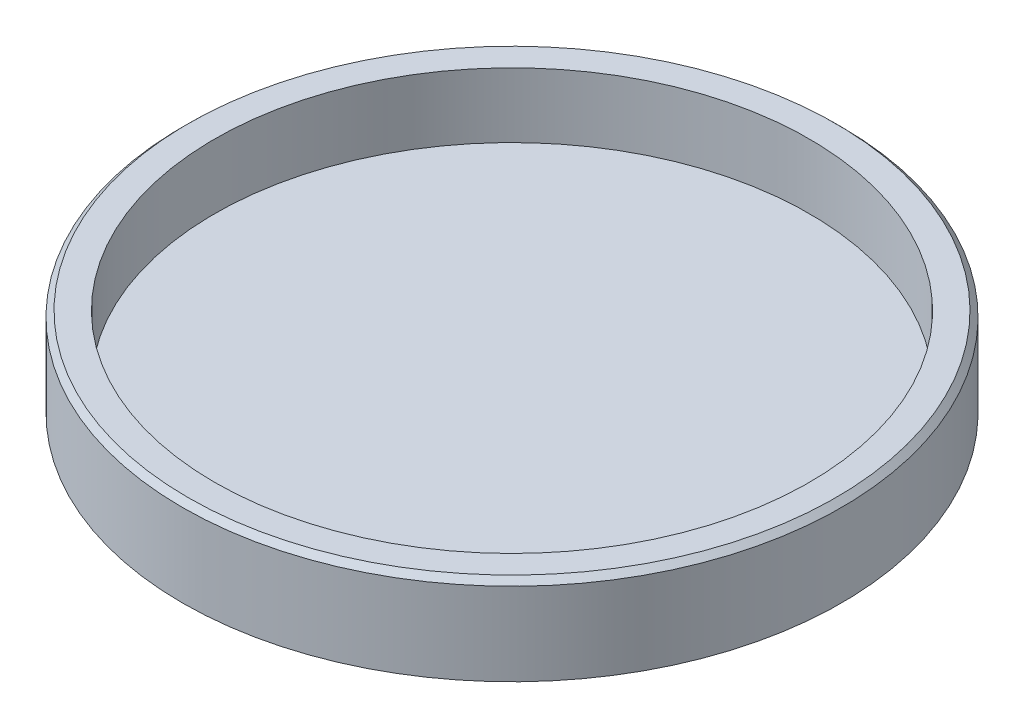
ISO-10303-21;
HEADER;
FILE_DESCRIPTION(('STEP AP214'),'2;1');
FILE_NAME('part.step','',(''),(''),'','','');
FILE_SCHEMA(('AUTOMOTIVE_DESIGN { 1 0 10303 214 1 1 1 1 }'));
ENDSEC;
DATA;
#1=APPLICATION_CONTEXT('core data for automotive mechanical design processes');
#2=APPLICATION_PROTOCOL_DEFINITION('international standard','automotive_design',2000,#1);
#3=PRODUCT_CONTEXT('',#1,'mechanical');
#4=PRODUCT('Part','Part','',(#3));
#5=PRODUCT_RELATED_PRODUCT_CATEGORY('part','',(#4));
#6=PRODUCT_DEFINITION_FORMATION('','',#4);
#7=PRODUCT_DEFINITION_CONTEXT('part definition',#1,'design');
#8=PRODUCT_DEFINITION('design','',#6,#7);
#9=PRODUCT_DEFINITION_SHAPE('','',#8);
#10=(LENGTH_UNIT() NAMED_UNIT(*) SI_UNIT(.MILLI.,.METRE.));
#11=(NAMED_UNIT(*) PLANE_ANGLE_UNIT() SI_UNIT($,.RADIAN.));
#12=(NAMED_UNIT(*) SI_UNIT($,.STERADIAN.) SOLID_ANGLE_UNIT());
#13=UNCERTAINTY_MEASURE_WITH_UNIT(LENGTH_MEASURE(1.E-05),#10,'distance_accuracy_value','');
#14=(GEOMETRIC_REPRESENTATION_CONTEXT(3) GLOBAL_UNCERTAINTY_ASSIGNED_CONTEXT((#13)) GLOBAL_UNIT_ASSIGNED_CONTEXT((#10,
#11,#12)) REPRESENTATION_CONTEXT('',''));
#15=CARTESIAN_POINT('',(0.,0.,0.));
#16=DIRECTION('',(0.,0.,1.));
#17=DIRECTION('',(1.,0.,0.));
#18=AXIS2_PLACEMENT_3D('',#15,#16,#17);
#19=CARTESIAN_POINT('',(0.,-1.9050279329609,0.));
#20=DIRECTION('',(0.,-1.,0.));
#21=DIRECTION('',(0.,0.,-1.));
#22=AXIS2_PLACEMENT_3D('',#19,#20,#21);
#23=PLANE('',#22);
#24=CARTESIAN_POINT('',(0.,-1.9050279329609,0.));
#25=DIRECTION('',(0.,1.,0.));
#26=DIRECTION('',(0.,0.,1.));
#27=AXIS2_PLACEMENT_3D('',#24,#25,#26);
#28=CIRCLE('',#27,18.5);
#29=CARTESIAN_POINT('',(0.,-1.9050279329609,18.5));
#30=VERTEX_POINT('',#29);
#31=EDGE_CURVE('E10',#30,#30,#28,.T.);
#32=ORIENTED_EDGE('',*,*,#31,.T.);
#33=EDGE_LOOP('',(#32));
#34=FACE_BOUND('',#33,.T.);
#35=ADVANCED_FACE('F35',(#34),#23,.F.);
#36=CARTESIAN_POINT('',(0.,9.55586592178772,0.));
#37=DIRECTION('',(0.,1.,0.));
#38=DIRECTION('',(0.,0.,1.));
#39=AXIS2_PLACEMENT_3D('',#36,#37,#38);
#40=CYLINDRICAL_SURFACE('',#39,18.5);
#41=ORIENTED_EDGE('',*,*,#31,.F.);
#42=EDGE_LOOP('',(#41));
#43=FACE_BOUND('',#42,.T.);
#44=CARTESIAN_POINT('',(0.,2.12172585243784,0.));
#45=DIRECTION('',(0.,1.,0.));
#46=DIRECTION('',(0.,0.,1.));
#47=AXIS2_PLACEMENT_3D('',#44,#45,#46);
#48=CIRCLE('',#47,18.5);
#49=CARTESIAN_POINT('',(0.,2.12172585243784,18.5));
#50=VERTEX_POINT('',#49);
#51=EDGE_CURVE('E41',#50,#50,#48,.T.);
#52=ORIENTED_EDGE('',*,*,#51,.T.);
#53=EDGE_LOOP('',(#52));
#54=FACE_BOUND('',#53,.T.);
#55=ADVANCED_FACE('F70',(#43,#54),#40,.F.);
#56=CARTESIAN_POINT('',(18.5,2.12172585243784,0.));
#57=DIRECTION('',(0.,-1.,0.));
#58=DIRECTION('',(0.,0.,-1.));
#59=AXIS2_PLACEMENT_3D('',#56,#57,#58);
#60=PLANE('',#59);
#61=ORIENTED_EDGE('',*,*,#51,.F.);
#62=EDGE_LOOP('',(#61));
#63=FACE_BOUND('',#62,.T.);
#64=CARTESIAN_POINT('',(0.,2.12172585243784,0.));
#65=DIRECTION('',(0.,1.,0.));
#66=DIRECTION('',(0.,0.,1.));
#67=AXIS2_PLACEMENT_3D('',#64,#65,#66);
#68=CIRCLE('',#67,20.1464466094067);
#69=CARTESIAN_POINT('',(0.,2.12172585243784,20.1464466094067));
#70=VERTEX_POINT('',#69);
#71=EDGE_CURVE('E45',#70,#70,#68,.T.);
#72=ORIENTED_EDGE('',*,*,#71,.T.);
#73=EDGE_LOOP('',(#72));
#74=FACE_BOUND('',#73,.T.);
#75=ADVANCED_FACE('F74',(#63,#74),#60,.F.);
#76=CARTESIAN_POINT('',(0.,1.76817246184457,0.));
#77=DIRECTION('',(0.,-1.,0.));
#78=DIRECTION('',(0.,0.,-1.));
#79=AXIS2_PLACEMENT_3D('',#76,#77,#78);
#80=CONICAL_SURFACE('',#79,20.5,0.78539816339744);
#81=ORIENTED_EDGE('',*,*,#71,.F.);
#82=EDGE_LOOP('',(#81));
#83=FACE_BOUND('',#82,.T.);
#84=CARTESIAN_POINT('',(0.,1.76817246184457,0.));
#85=DIRECTION('',(0.,1.,0.));
#86=DIRECTION('',(0.,0.,1.));
#87=AXIS2_PLACEMENT_3D('',#84,#85,#86);
#88=CIRCLE('',#87,20.5);
#89=CARTESIAN_POINT('',(0.,1.76817246184457,20.5));
#90=VERTEX_POINT('',#89);
#91=EDGE_CURVE('E49',#90,#90,#88,.T.);
#92=ORIENTED_EDGE('',*,*,#91,.T.);
#93=EDGE_LOOP('',(#92));
#94=FACE_BOUND('',#93,.T.);
#95=ADVANCED_FACE('F66',(#83,#94),#80,.T.);
#96=CARTESIAN_POINT('',(0.,9.55586592178772,0.));
#97=DIRECTION('',(0.,1.,0.));
#98=DIRECTION('',(0.,0.,1.));
#99=AXIS2_PLACEMENT_3D('',#96,#97,#98);
#100=CYLINDRICAL_SURFACE('',#99,20.5);
#101=ORIENTED_EDGE('',*,*,#91,.F.);
#102=EDGE_LOOP('',(#101));
#103=FACE_BOUND('',#102,.T.);
#104=CARTESIAN_POINT('',(0.,-3.37827414756216,0.));
#105=DIRECTION('',(0.,1.,0.));
#106=DIRECTION('',(0.,0.,1.));
#107=AXIS2_PLACEMENT_3D('',#104,#105,#106);
#108=CIRCLE('',#107,20.5);
#109=CARTESIAN_POINT('',(0.,-3.37827414756216,20.5));
#110=VERTEX_POINT('',#109);
#111=EDGE_CURVE('E54',#110,#110,#108,.T.);
#112=ORIENTED_EDGE('',*,*,#111,.T.);
#113=EDGE_LOOP('',(#112));
#114=FACE_BOUND('',#113,.T.);
#115=ADVANCED_FACE('F58',(#103,#114),#100,.T.);
#116=CARTESIAN_POINT('',(20.5,-3.37827414756216,0.));
#117=DIRECTION('',(0.,1.,0.));
#118=DIRECTION('',(0.,0.,1.));
#119=AXIS2_PLACEMENT_3D('',#116,#117,#118);
#120=PLANE('',#119);
#121=ORIENTED_EDGE('',*,*,#111,.F.);
#122=EDGE_LOOP('',(#121));
#123=FACE_BOUND('',#122,.T.);
#124=ADVANCED_FACE('F60',(#123),#120,.F.);
#125=CLOSED_SHELL('',(#35,#55,#75,#95,#115,#124));
#126=MANIFOLD_SOLID_BREP('B2',#125);
#127=ADVANCED_BREP_SHAPE_REPRESENTATION('',(#18,#126),#14);
#128=SHAPE_DEFINITION_REPRESENTATION(#9,#127);
ENDSEC;
END-ISO-10303-21;
